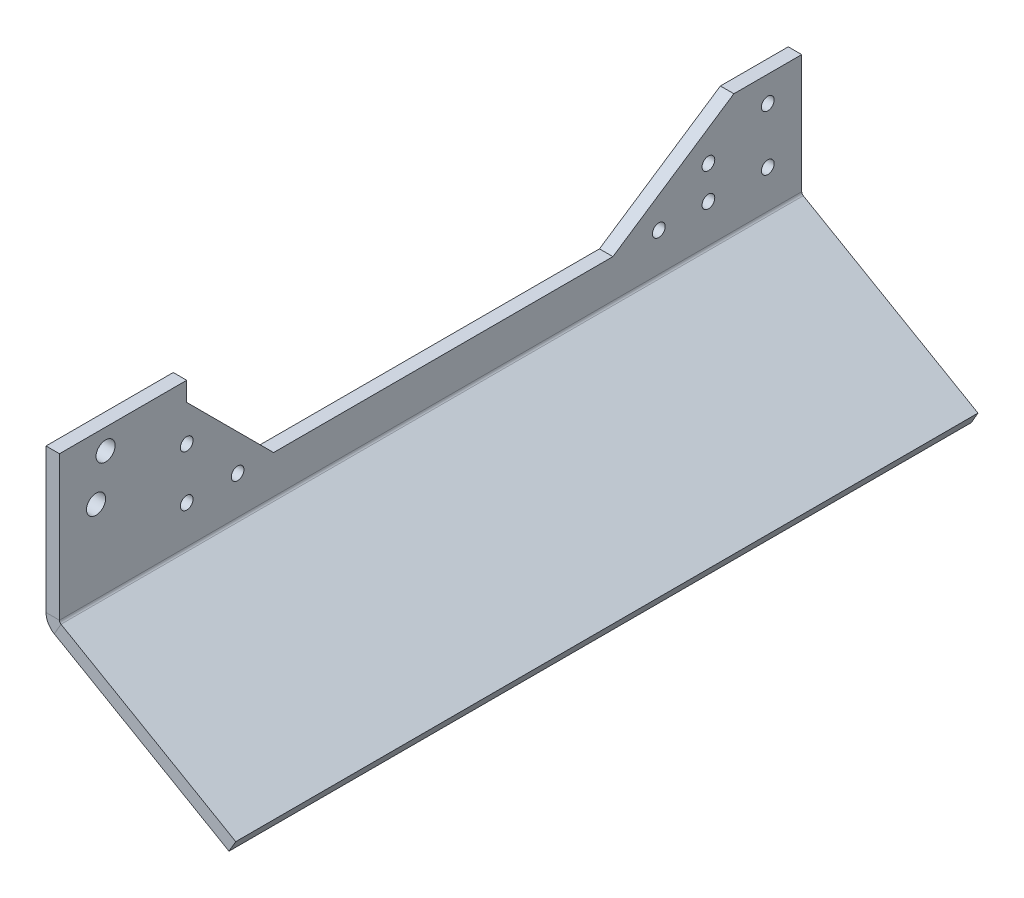
ISO-10303-21;
HEADER;
FILE_DESCRIPTION(('STEP AP214'),'2;1');
FILE_NAME('part.step','',(''),(''),'','','');
FILE_SCHEMA(('AUTOMOTIVE_DESIGN { 1 0 10303 214 1 1 1 1 }'));
ENDSEC;
DATA;
#1=APPLICATION_CONTEXT('core data for automotive mechanical design processes');
#2=APPLICATION_PROTOCOL_DEFINITION('international standard','automotive_design',2000,#1);
#3=PRODUCT_CONTEXT('',#1,'mechanical');
#4=PRODUCT('Part','Part','',(#3));
#5=PRODUCT_RELATED_PRODUCT_CATEGORY('part','',(#4));
#6=PRODUCT_DEFINITION_FORMATION('','',#4);
#7=PRODUCT_DEFINITION_CONTEXT('part definition',#1,'design');
#8=PRODUCT_DEFINITION('design','',#6,#7);
#9=PRODUCT_DEFINITION_SHAPE('','',#8);
#10=(LENGTH_UNIT() NAMED_UNIT(*) SI_UNIT(.MILLI.,.METRE.));
#11=(NAMED_UNIT(*) PLANE_ANGLE_UNIT() SI_UNIT($,.RADIAN.));
#12=(NAMED_UNIT(*) SI_UNIT($,.STERADIAN.) SOLID_ANGLE_UNIT());
#13=UNCERTAINTY_MEASURE_WITH_UNIT(LENGTH_MEASURE(1.E-05),#10,'distance_accuracy_value','');
#14=(GEOMETRIC_REPRESENTATION_CONTEXT(3) GLOBAL_UNCERTAINTY_ASSIGNED_CONTEXT((#13)) GLOBAL_UNIT_ASSIGNED_CONTEXT((#10,
#11,#12)) REPRESENTATION_CONTEXT('',''));
#15=CARTESIAN_POINT('',(0.,0.,0.));
#16=DIRECTION('',(0.,0.,1.));
#17=DIRECTION('',(1.,0.,0.));
#18=AXIS2_PLACEMENT_3D('',#15,#16,#17);
#19=CARTESIAN_POINT('',(1.43557444879162,0.578981601940387,0.));
#20=DIRECTION('',(0.499999999999998,0.86602540378444,0.));
#21=DIRECTION('',(0.,0.,-1.));
#22=AXIS2_PLACEMENT_3D('',#19,#20,#21);
#23=PLANE('',#22);
#24=DIRECTION('',(-0.86602540378444,0.499999999999998,0.));
#25=VECTOR('',#24,1.);
#26=CARTESIAN_POINT('',(44.7368446380136,-24.4210183980595,-160.884918300919));
#27=LINE('',#26,#25);
#28=CARTESIAN_POINT('',(44.7368446380136,-24.4210183980595,-160.884918300919));
#29=VERTEX_POINT('',#28);
#30=CARTESIAN_POINT('',(3.5433,-0.637914312427618,-160.884918300919));
#31=VERTEX_POINT('',#30);
#32=EDGE_CURVE('E46',#29,#31,#27,.T.);
#33=ORIENTED_EDGE('',*,*,#32,.T.);
#34=DIRECTION('',(0.,0.,1.));
#35=VECTOR('',#34,1.);
#36=CARTESIAN_POINT('',(3.5433,-0.637914312427617,0.));
#37=LINE('',#36,#35);
#38=CARTESIAN_POINT('',(3.5433,-0.637914312427615,14.1150816990808));
#39=VERTEX_POINT('',#38);
#40=EDGE_CURVE('E104',#31,#39,#37,.T.);
#41=ORIENTED_EDGE('',*,*,#40,.T.);
#42=DIRECTION('',(0.86602540378444,-0.499999999999998,0.));
#43=VECTOR('',#42,1.);
#44=CARTESIAN_POINT('',(-28.0092892798793,17.5789816019403,14.1150816990808));
#45=LINE('',#44,#43);
#46=CARTESIAN_POINT('',(44.7368446380136,-24.4210183980595,14.1150816990808));
#47=VERTEX_POINT('',#46);
#48=EDGE_CURVE('E91',#39,#47,#45,.T.);
#49=ORIENTED_EDGE('',*,*,#48,.T.);
#50=DIRECTION('',(0.,0.,-1.));
#51=VECTOR('',#50,1.);
#52=CARTESIAN_POINT('',(44.7368446380136,-24.4210183980595,14.1150816990808));
#53=LINE('',#52,#51);
#54=EDGE_CURVE('E67',#47,#29,#53,.T.);
#55=ORIENTED_EDGE('',*,*,#54,.T.);
#56=EDGE_LOOP('',(#33,#41,#49,#55));
#57=FACE_BOUND('',#56,.T.);
#58=ADVANCED_FACE('F42',(#57),#23,.T.);
#59=CARTESIAN_POINT('',(-0.15192555120837,-2.17064905507521,0.));
#60=DIRECTION('',(0.499999999999998,0.86602540378444,0.));
#61=DIRECTION('',(0.,0.,-1.));
#62=AXIS2_PLACEMENT_3D('',#59,#60,#61);
#63=PLANE('',#62);
#64=DIRECTION('',(0.,0.,1.));
#65=VECTOR('',#64,1.);
#66=CARTESIAN_POINT('',(1.95580000000001,-3.38754496944321,0.));
#67=LINE('',#66,#65);
#68=CARTESIAN_POINT('',(1.95580000000001,-3.38754496944321,-160.884918300919));
#69=VERTEX_POINT('',#68);
#70=CARTESIAN_POINT('',(1.95580000000001,-3.38754496944321,14.1150816990808));
#71=VERTEX_POINT('',#70);
#72=EDGE_CURVE('E51',#69,#71,#67,.T.);
#73=ORIENTED_EDGE('',*,*,#72,.F.);
#74=DIRECTION('',(-0.86602540378444,0.499999999999998,0.));
#75=VECTOR('',#74,1.);
#76=CARTESIAN_POINT('',(-24.4006368571727,11.8293509449247,-160.884918300919));
#77=LINE('',#76,#75);
#78=CARTESIAN_POINT('',(43.1493446380136,-27.1706490550751,-160.884918300919));
#79=VERTEX_POINT('',#78);
#80=EDGE_CURVE('E81',#79,#69,#77,.T.);
#81=ORIENTED_EDGE('',*,*,#80,.F.);
#82=DIRECTION('',(0.,0.,-1.));
#83=VECTOR('',#82,1.);
#84=CARTESIAN_POINT('',(43.1493446380136,-27.1706490550751,14.1150816990808));
#85=LINE('',#84,#83);
#86=CARTESIAN_POINT('',(43.1493446380136,-27.1706490550751,14.1150816990808));
#87=VERTEX_POINT('',#86);
#88=EDGE_CURVE('E85',#87,#79,#85,.T.);
#89=ORIENTED_EDGE('',*,*,#88,.F.);
#90=DIRECTION('',(0.86602540378444,-0.499999999999998,0.));
#91=VECTOR('',#90,1.);
#92=CARTESIAN_POINT('',(-0.15192555120837,-2.17064905507521,14.1150816990808));
#93=LINE('',#92,#91);
#94=EDGE_CURVE('E100',#71,#87,#93,.T.);
#95=ORIENTED_EDGE('',*,*,#94,.F.);
#96=EDGE_LOOP('',(#73,#81,#89,#95));
#97=FACE_BOUND('',#96,.T.);
#98=ADVANCED_FACE('F83',(#97),#63,.F.);
#99=CARTESIAN_POINT('',(1.43557444879162,0.578981601940387,14.1150816990808));
#100=DIRECTION('',(0.,0.,-1.));
#101=DIRECTION('',(-0.86602540378444,0.499999999999998,0.));
#102=AXIS2_PLACEMENT_3D('',#99,#100,#101);
#103=PLANE('',#102);
#104=DIRECTION('',(0.499999999999998,0.86602540378444,0.));
#105=VECTOR('',#104,1.);
#106=CARTESIAN_POINT('',(3.5433,-0.637914312427617,14.1150816990808));
#107=LINE('',#106,#105);
#108=EDGE_CURVE('E12',#71,#39,#107,.T.);
#109=ORIENTED_EDGE('',*,*,#108,.F.);
#110=ORIENTED_EDGE('',*,*,#94,.T.);
#111=DIRECTION('',(-0.499999999999998,-0.86602540378444,0.));
#112=VECTOR('',#111,1.);
#113=CARTESIAN_POINT('',(44.7368446380136,-24.4210183980595,14.1150816990808));
#114=LINE('',#113,#112);
#115=EDGE_CURVE('E99',#47,#87,#114,.T.);
#116=ORIENTED_EDGE('',*,*,#115,.F.);
#117=ORIENTED_EDGE('',*,*,#48,.F.);
#118=EDGE_LOOP('',(#109,#110,#116,#117));
#119=FACE_BOUND('',#118,.T.);
#120=ADVANCED_FACE('F44',(#119),#103,.F.);
#121=CARTESIAN_POINT('',(44.7368446380136,-24.4210183980595,14.1150816990808));
#122=DIRECTION('',(-0.86602540378444,0.499999999999998,0.));
#123=DIRECTION('',(0.,0.,1.));
#124=AXIS2_PLACEMENT_3D('',#121,#122,#123);
#125=PLANE('',#124);
#126=ORIENTED_EDGE('',*,*,#88,.T.);
#127=DIRECTION('',(-0.499999999999998,-0.86602540378444,0.));
#128=VECTOR('',#127,1.);
#129=CARTESIAN_POINT('',(44.7368446380136,-24.4210183980595,-160.884918300919));
#130=LINE('',#129,#128);
#131=EDGE_CURVE('E96',#29,#79,#130,.T.);
#132=ORIENTED_EDGE('',*,*,#131,.F.);
#133=ORIENTED_EDGE('',*,*,#54,.F.);
#134=ORIENTED_EDGE('',*,*,#115,.T.);
#135=EDGE_LOOP('',(#126,#132,#133,#134));
#136=FACE_BOUND('',#135,.T.);
#137=ADVANCED_FACE('F95',(#136),#125,.F.);
#138=CARTESIAN_POINT('',(-22.8131368571727,14.5789816019403,-160.884918300919));
#139=DIRECTION('',(0.,0.,1.));
#140=DIRECTION('',(0.499999999999998,0.86602540378444,0.));
#141=AXIS2_PLACEMENT_3D('',#138,#139,#140);
#142=PLANE('',#141);
#143=DIRECTION('',(-0.499999999999998,-0.86602540378444,0.));
#144=VECTOR('',#143,1.);
#145=CARTESIAN_POINT('',(3.5433,-0.637914312427617,-160.884918300919));
#146=LINE('',#145,#144);
#147=EDGE_CURVE('E110',#31,#69,#146,.T.);
#148=ORIENTED_EDGE('',*,*,#147,.F.);
#149=ORIENTED_EDGE('',*,*,#32,.F.);
#150=ORIENTED_EDGE('',*,*,#131,.T.);
#151=ORIENTED_EDGE('',*,*,#80,.T.);
#152=EDGE_LOOP('',(#148,#149,#150,#151));
#153=FACE_BOUND('',#152,.T.);
#154=ADVANCED_FACE('F102',(#153),#142,.F.);
#155=CARTESIAN_POINT('',(3.175,16.7921072428128,-138.88491830092));
#156=DIRECTION('',(-1.,0.,0.));
#157=DIRECTION('',(0.,0.,1.));
#158=AXIS2_PLACEMENT_3D('',#155,#156,#157);
#159=CYLINDRICAL_SURFACE('',#158,1.5);
#160=CARTESIAN_POINT('',(3.175,16.7921072428128,-138.88491830092));
#161=DIRECTION('',(1.,0.,0.));
#162=DIRECTION('',(0.,0.,-1.));
#163=AXIS2_PLACEMENT_3D('',#160,#161,#162);
#164=CIRCLE('',#163,1.5);
#165=CARTESIAN_POINT('',(3.175,16.7921072428128,-140.38491830092));
#166=VERTEX_POINT('',#165);
#167=EDGE_CURVE('E119',#166,#166,#164,.T.);
#168=ORIENTED_EDGE('',*,*,#167,.T.);
#169=EDGE_LOOP('',(#168));
#170=FACE_BOUND('',#169,.T.);
#171=CARTESIAN_POINT('',(0.,16.7921072428128,-138.88491830092));
#172=DIRECTION('',(1.,0.,0.));
#173=DIRECTION('',(0.,0.,-1.));
#174=AXIS2_PLACEMENT_3D('',#171,#172,#173);
#175=CIRCLE('',#174,1.5);
#176=CARTESIAN_POINT('',(0.,16.7921072428128,-140.38491830092));
#177=VERTEX_POINT('',#176);
#178=EDGE_CURVE('E242',#177,#177,#175,.T.);
#179=ORIENTED_EDGE('',*,*,#178,.F.);
#180=EDGE_LOOP('',(#179));
#181=FACE_BOUND('',#180,.T.);
#182=ADVANCED_FACE('F378',(#170,#181),#159,.F.);
#183=CARTESIAN_POINT('',(3.175,9.,-138.88491830092));
#184=DIRECTION('',(-1.,0.,0.));
#185=DIRECTION('',(0.,0.,1.));
#186=AXIS2_PLACEMENT_3D('',#183,#184,#185);
#187=CYLINDRICAL_SURFACE('',#186,1.5);
#188=CARTESIAN_POINT('',(3.175,9.,-138.88491830092));
#189=DIRECTION('',(1.,0.,0.));
#190=DIRECTION('',(0.,0.,-1.));
#191=AXIS2_PLACEMENT_3D('',#188,#189,#190);
#192=CIRCLE('',#191,1.5);
#193=CARTESIAN_POINT('',(3.175,9.,-140.38491830092));
#194=VERTEX_POINT('',#193);
#195=EDGE_CURVE('E122',#194,#194,#192,.T.);
#196=ORIENTED_EDGE('',*,*,#195,.T.);
#197=EDGE_LOOP('',(#196));
#198=FACE_BOUND('',#197,.T.);
#199=CARTESIAN_POINT('',(0.,9.,-138.88491830092));
#200=DIRECTION('',(1.,0.,0.));
#201=DIRECTION('',(0.,0.,-1.));
#202=AXIS2_PLACEMENT_3D('',#199,#200,#201);
#203=CIRCLE('',#202,1.5);
#204=CARTESIAN_POINT('',(0.,9.,-140.38491830092));
#205=VERTEX_POINT('',#204);
#206=EDGE_CURVE('E236',#205,#205,#203,.T.);
#207=ORIENTED_EDGE('',*,*,#206,.F.);
#208=EDGE_LOOP('',(#207));
#209=FACE_BOUND('',#208,.T.);
#210=ADVANCED_FACE('F383',(#198,#209),#187,.F.);
#211=CARTESIAN_POINT('',(3.175,8.99999999999999,-15.8849183009192));
#212=DIRECTION('',(-1.,0.,0.));
#213=DIRECTION('',(0.,0.,1.));
#214=AXIS2_PLACEMENT_3D('',#211,#212,#213);
#215=CYLINDRICAL_SURFACE('',#214,1.49999999999978);
#216=CARTESIAN_POINT('',(3.175,8.99999999999999,-15.8849183009192));
#217=DIRECTION('',(1.,0.,0.));
#218=DIRECTION('',(0.,0.,-1.));
#219=AXIS2_PLACEMENT_3D('',#216,#217,#218);
#220=CIRCLE('',#219,1.49999999999978);
#221=CARTESIAN_POINT('',(3.175,8.99999999999999,-17.384918300919));
#222=VERTEX_POINT('',#221);
#223=EDGE_CURVE('E125',#222,#222,#220,.T.);
#224=ORIENTED_EDGE('',*,*,#223,.T.);
#225=EDGE_LOOP('',(#224));
#226=FACE_BOUND('',#225,.T.);
#227=CARTESIAN_POINT('',(0.,8.99999999999999,-15.8849183009192));
#228=DIRECTION('',(1.,0.,0.));
#229=DIRECTION('',(0.,0.,-1.));
#230=AXIS2_PLACEMENT_3D('',#227,#228,#229);
#231=CIRCLE('',#230,1.49999999999978);
#232=CARTESIAN_POINT('',(0.,8.99999999999999,-17.384918300919));
#233=VERTEX_POINT('',#232);
#234=EDGE_CURVE('E230',#233,#233,#231,.T.);
#235=ORIENTED_EDGE('',*,*,#234,.F.);
#236=EDGE_LOOP('',(#235));
#237=FACE_BOUND('',#236,.T.);
#238=ADVANCED_FACE('F406',(#226,#237),#215,.F.);
#239=CARTESIAN_POINT('',(3.175,9.,-152.884918300919));
#240=DIRECTION('',(-1.,0.,0.));
#241=DIRECTION('',(0.,0.,1.));
#242=AXIS2_PLACEMENT_3D('',#239,#240,#241);
#243=CYLINDRICAL_SURFACE('',#242,1.5);
#244=CARTESIAN_POINT('',(3.175,9.,-152.884918300919));
#245=DIRECTION('',(1.,0.,0.));
#246=DIRECTION('',(0.,0.,-1.));
#247=AXIS2_PLACEMENT_3D('',#244,#245,#246);
#248=CIRCLE('',#247,1.5);
#249=CARTESIAN_POINT('',(3.175,9.,-154.384918300919));
#250=VERTEX_POINT('',#249);
#251=EDGE_CURVE('E128',#250,#250,#248,.T.);
#252=ORIENTED_EDGE('',*,*,#251,.T.);
#253=EDGE_LOOP('',(#252));
#254=FACE_BOUND('',#253,.T.);
#255=CARTESIAN_POINT('',(0.,9.,-152.884918300919));
#256=DIRECTION('',(1.,0.,0.));
#257=DIRECTION('',(0.,0.,-1.));
#258=AXIS2_PLACEMENT_3D('',#255,#256,#257);
#259=CIRCLE('',#258,1.5);
#260=CARTESIAN_POINT('',(0.,9.,-154.384918300919));
#261=VERTEX_POINT('',#260);
#262=EDGE_CURVE('E224',#261,#261,#259,.T.);
#263=ORIENTED_EDGE('',*,*,#262,.F.);
#264=EDGE_LOOP('',(#263));
#265=FACE_BOUND('',#264,.T.);
#266=ADVANCED_FACE('F410',(#254,#265),#243,.F.);
#267=CARTESIAN_POINT('',(3.175,22.,-152.884918300919));
#268=DIRECTION('',(-1.,0.,0.));
#269=DIRECTION('',(0.,0.,1.));
#270=AXIS2_PLACEMENT_3D('',#267,#268,#269);
#271=CYLINDRICAL_SURFACE('',#270,1.5);
#272=CARTESIAN_POINT('',(3.175,22.,-152.884918300919));
#273=DIRECTION('',(1.,0.,0.));
#274=DIRECTION('',(0.,0.,-1.));
#275=AXIS2_PLACEMENT_3D('',#272,#273,#274);
#276=CIRCLE('',#275,1.5);
#277=CARTESIAN_POINT('',(3.175,22.,-154.384918300919));
#278=VERTEX_POINT('',#277);
#279=EDGE_CURVE('E131',#278,#278,#276,.T.);
#280=ORIENTED_EDGE('',*,*,#279,.T.);
#281=EDGE_LOOP('',(#280));
#282=FACE_BOUND('',#281,.T.);
#283=CARTESIAN_POINT('',(0.,22.,-152.884918300919));
#284=DIRECTION('',(1.,0.,0.));
#285=DIRECTION('',(0.,0.,-1.));
#286=AXIS2_PLACEMENT_3D('',#283,#284,#285);
#287=CIRCLE('',#286,1.5);
#288=CARTESIAN_POINT('',(0.,22.,-154.384918300919));
#289=VERTEX_POINT('',#288);
#290=EDGE_CURVE('E218',#289,#289,#287,.T.);
#291=ORIENTED_EDGE('',*,*,#290,.F.);
#292=EDGE_LOOP('',(#291));
#293=FACE_BOUND('',#292,.T.);
#294=ADVANCED_FACE('F414',(#282,#293),#271,.F.);
#295=CARTESIAN_POINT('',(3.175,29.1280440215269,3.23937923257457));
#296=DIRECTION('',(-1.,0.,0.));
#297=DIRECTION('',(0.,0.,1.));
#298=AXIS2_PLACEMENT_3D('',#295,#296,#297);
#299=CYLINDRICAL_SURFACE('',#298,2.25);
#300=CARTESIAN_POINT('',(3.175,29.1280440215269,3.23937923257457));
#301=DIRECTION('',(1.,0.,0.));
#302=DIRECTION('',(0.,0.,-1.));
#303=AXIS2_PLACEMENT_3D('',#300,#301,#302);
#304=CIRCLE('',#303,2.25);
#305=CARTESIAN_POINT('',(3.175,29.1280440215269,0.989379232574577));
#306=VERTEX_POINT('',#305);
#307=EDGE_CURVE('E134',#306,#306,#304,.T.);
#308=ORIENTED_EDGE('',*,*,#307,.T.);
#309=EDGE_LOOP('',(#308));
#310=FACE_BOUND('',#309,.T.);
#311=CARTESIAN_POINT('',(0.,29.1280440215269,3.23937923257457));
#312=DIRECTION('',(1.,0.,0.));
#313=DIRECTION('',(0.,0.,-1.));
#314=AXIS2_PLACEMENT_3D('',#311,#312,#313);
#315=CIRCLE('',#314,2.25);
#316=CARTESIAN_POINT('',(0.,29.1280440215269,0.989379232574577));
#317=VERTEX_POINT('',#316);
#318=EDGE_CURVE('E215',#317,#317,#315,.T.);
#319=ORIENTED_EDGE('',*,*,#318,.F.);
#320=EDGE_LOOP('',(#319));
#321=FACE_BOUND('',#320,.T.);
#322=ADVANCED_FACE('F418',(#310,#321),#299,.F.);
#323=CARTESIAN_POINT('',(3.175,19.3841320645807,5.48797429956215));
#324=DIRECTION('',(-1.,0.,0.));
#325=DIRECTION('',(0.,0.,1.));
#326=AXIS2_PLACEMENT_3D('',#323,#324,#325);
#327=CYLINDRICAL_SURFACE('',#326,2.25);
#328=CARTESIAN_POINT('',(3.175,19.3841320645807,5.48797429956215));
#329=DIRECTION('',(1.,0.,0.));
#330=DIRECTION('',(0.,0.,-1.));
#331=AXIS2_PLACEMENT_3D('',#328,#329,#330);
#332=CIRCLE('',#331,2.25);
#333=CARTESIAN_POINT('',(3.175,19.3841320645807,3.23797429956215));
#334=VERTEX_POINT('',#333);
#335=EDGE_CURVE('E137',#334,#334,#332,.T.);
#336=ORIENTED_EDGE('',*,*,#335,.T.);
#337=EDGE_LOOP('',(#336));
#338=FACE_BOUND('',#337,.T.);
#339=CARTESIAN_POINT('',(0.,19.3841320645807,5.48797429956215));
#340=DIRECTION('',(1.,0.,0.));
#341=DIRECTION('',(0.,0.,-1.));
#342=AXIS2_PLACEMENT_3D('',#339,#340,#341);
#343=CIRCLE('',#342,2.25);
#344=CARTESIAN_POINT('',(0.,19.3841320645807,3.23797429956215));
#345=VERTEX_POINT('',#344);
#346=EDGE_CURVE('E221',#345,#345,#343,.T.);
#347=ORIENTED_EDGE('',*,*,#346,.F.);
#348=EDGE_LOOP('',(#347));
#349=FACE_BOUND('',#348,.T.);
#350=ADVANCED_FACE('F422',(#338,#349),#327,.F.);
#351=CARTESIAN_POINT('',(3.175,21.,-15.8849183009192));
#352=DIRECTION('',(-1.,0.,0.));
#353=DIRECTION('',(0.,0.,1.));
#354=AXIS2_PLACEMENT_3D('',#351,#352,#353);
#355=CYLINDRICAL_SURFACE('',#354,1.5);
#356=CARTESIAN_POINT('',(3.175,21.,-15.8849183009192));
#357=DIRECTION('',(1.,0.,0.));
#358=DIRECTION('',(0.,0.,-1.));
#359=AXIS2_PLACEMENT_3D('',#356,#357,#358);
#360=CIRCLE('',#359,1.5);
#361=CARTESIAN_POINT('',(3.175,21.,-17.3849183009192));
#362=VERTEX_POINT('',#361);
#363=EDGE_CURVE('E140',#362,#362,#360,.T.);
#364=ORIENTED_EDGE('',*,*,#363,.T.);
#365=EDGE_LOOP('',(#364));
#366=FACE_BOUND('',#365,.T.);
#367=CARTESIAN_POINT('',(0.,21.,-15.8849183009192));
#368=DIRECTION('',(1.,0.,0.));
#369=DIRECTION('',(0.,0.,-1.));
#370=AXIS2_PLACEMENT_3D('',#367,#368,#369);
#371=CIRCLE('',#370,1.5);
#372=CARTESIAN_POINT('',(0.,21.,-17.3849183009192));
#373=VERTEX_POINT('',#372);
#374=EDGE_CURVE('E227',#373,#373,#371,.T.);
#375=ORIENTED_EDGE('',*,*,#374,.F.);
#376=EDGE_LOOP('',(#375));
#377=FACE_BOUND('',#376,.T.);
#378=ADVANCED_FACE('F426',(#366,#377),#355,.F.);
#379=CARTESIAN_POINT('',(3.175,8.99999999999998,-27.8849183009192));
#380=DIRECTION('',(-1.,0.,0.));
#381=DIRECTION('',(0.,0.,1.));
#382=AXIS2_PLACEMENT_3D('',#379,#380,#381);
#383=CYLINDRICAL_SURFACE('',#382,1.5);
#384=CARTESIAN_POINT('',(3.175,8.99999999999998,-27.8849183009192));
#385=DIRECTION('',(1.,0.,0.));
#386=DIRECTION('',(0.,0.,-1.));
#387=AXIS2_PLACEMENT_3D('',#384,#385,#386);
#388=CIRCLE('',#387,1.5);
#389=CARTESIAN_POINT('',(3.175,8.99999999999998,-29.3849183009192));
#390=VERTEX_POINT('',#389);
#391=EDGE_CURVE('E143',#390,#390,#388,.T.);
#392=ORIENTED_EDGE('',*,*,#391,.T.);
#393=EDGE_LOOP('',(#392));
#394=FACE_BOUND('',#393,.T.);
#395=CARTESIAN_POINT('',(0.,8.99999999999998,-27.8849183009192));
#396=DIRECTION('',(1.,0.,0.));
#397=DIRECTION('',(0.,0.,-1.));
#398=AXIS2_PLACEMENT_3D('',#395,#396,#397);
#399=CIRCLE('',#398,1.5);
#400=CARTESIAN_POINT('',(0.,8.99999999999998,-29.3849183009192));
#401=VERTEX_POINT('',#400);
#402=EDGE_CURVE('E233',#401,#401,#399,.T.);
#403=ORIENTED_EDGE('',*,*,#402,.F.);
#404=EDGE_LOOP('',(#403));
#405=FACE_BOUND('',#404,.T.);
#406=ADVANCED_FACE('F430',(#394,#405),#383,.F.);
#407=CARTESIAN_POINT('',(3.175,9.,-127.190721167732));
#408=DIRECTION('',(-1.,0.,0.));
#409=DIRECTION('',(0.,0.,1.));
#410=AXIS2_PLACEMENT_3D('',#407,#408,#409);
#411=CYLINDRICAL_SURFACE('',#410,1.50000000000003);
#412=CARTESIAN_POINT('',(3.175,9.,-127.190721167732));
#413=DIRECTION('',(1.,0.,0.));
#414=DIRECTION('',(0.,0.,-1.));
#415=AXIS2_PLACEMENT_3D('',#412,#413,#414);
#416=CIRCLE('',#415,1.50000000000003);
#417=CARTESIAN_POINT('',(3.175,9.,-128.690721167732));
#418=VERTEX_POINT('',#417);
#419=EDGE_CURVE('E146',#418,#418,#416,.T.);
#420=ORIENTED_EDGE('',*,*,#419,.T.);
#421=EDGE_LOOP('',(#420));
#422=FACE_BOUND('',#421,.T.);
#423=CARTESIAN_POINT('',(0.,9.,-127.190721167732));
#424=DIRECTION('',(1.,0.,0.));
#425=DIRECTION('',(0.,0.,-1.));
#426=AXIS2_PLACEMENT_3D('',#423,#424,#425);
#427=CIRCLE('',#426,1.50000000000003);
#428=CARTESIAN_POINT('',(0.,9.,-128.690721167732));
#429=VERTEX_POINT('',#428);
#430=EDGE_CURVE('E239',#429,#429,#427,.T.);
#431=ORIENTED_EDGE('',*,*,#430,.F.);
#432=EDGE_LOOP('',(#431));
#433=FACE_BOUND('',#432,.T.);
#434=ADVANCED_FACE('F434',(#422,#433),#411,.F.);
#435=CARTESIAN_POINT('',(3.175,34.,-15.8849183009192));
#436=DIRECTION('',(0.,-1.,0.));
#437=DIRECTION('',(0.,0.,-1.));
#438=AXIS2_PLACEMENT_3D('',#435,#436,#437);
#439=PLANE('',#438);
#440=DIRECTION('',(0.,0.,1.));
#441=VECTOR('',#440,1.);
#442=CARTESIAN_POINT('',(0.,34.,-15.8849183009192));
#443=LINE('',#442,#441);
#444=CARTESIAN_POINT('',(0.,34.,-15.8849183009192));
#445=VERTEX_POINT('',#444);
#446=CARTESIAN_POINT('',(0.,34.,14.1150816990808));
#447=VERTEX_POINT('',#446);
#448=EDGE_CURVE('E149',#445,#447,#443,.T.);
#449=ORIENTED_EDGE('',*,*,#448,.T.);
#450=DIRECTION('',(-1.,0.,0.));
#451=VECTOR('',#450,1.);
#452=CARTESIAN_POINT('',(3.175,34.,14.1150816990808));
#453=LINE('',#452,#451);
#454=CARTESIAN_POINT('',(3.175,34.,14.1150816990808));
#455=VERTEX_POINT('',#454);
#456=EDGE_CURVE('E114',#455,#447,#453,.T.);
#457=ORIENTED_EDGE('',*,*,#456,.F.);
#458=DIRECTION('',(0.,0.,1.));
#459=VECTOR('',#458,1.);
#460=CARTESIAN_POINT('',(3.175,34.,-15.8849183009192));
#461=LINE('',#460,#459);
#462=CARTESIAN_POINT('',(3.175,34.,-15.8849183009192));
#463=VERTEX_POINT('',#462);
#464=EDGE_CURVE('E203',#463,#455,#461,.T.);
#465=ORIENTED_EDGE('',*,*,#464,.F.);
#466=DIRECTION('',(-1.,0.,0.));
#467=VECTOR('',#466,1.);
#468=CARTESIAN_POINT('',(3.175,34.,-15.8849183009192));
#469=LINE('',#468,#467);
#470=EDGE_CURVE('E152',#463,#445,#469,.T.);
#471=ORIENTED_EDGE('',*,*,#470,.T.);
#472=EDGE_LOOP('',(#449,#457,#465,#471));
#473=FACE_BOUND('',#472,.T.);
#474=ADVANCED_FACE('F347',(#473),#439,.F.);
#475=CARTESIAN_POINT('',(3.175,29.4852813742386,-15.8849183009192));
#476=DIRECTION('',(0.,0.,1.));
#477=DIRECTION('',(1.,0.,0.));
#478=AXIS2_PLACEMENT_3D('',#475,#476,#477);
#479=PLANE('',#478);
#480=DIRECTION('',(0.,1.,0.));
#481=VECTOR('',#480,1.);
#482=CARTESIAN_POINT('',(0.,29.4852813742386,-15.8849183009192));
#483=LINE('',#482,#481);
#484=CARTESIAN_POINT('',(0.,29.4852813742386,-15.8849183009192));
#485=VERTEX_POINT('',#484);
#486=EDGE_CURVE('E155',#485,#445,#483,.T.);
#487=ORIENTED_EDGE('',*,*,#486,.T.);
#488=ORIENTED_EDGE('',*,*,#470,.F.);
#489=DIRECTION('',(0.,1.,0.));
#490=VECTOR('',#489,1.);
#491=CARTESIAN_POINT('',(3.175,29.4852813742386,-15.8849183009192));
#492=LINE('',#491,#490);
#493=CARTESIAN_POINT('',(3.175,29.4852813742386,-15.8849183009192));
#494=VERTEX_POINT('',#493);
#495=EDGE_CURVE('E200',#494,#463,#492,.T.);
#496=ORIENTED_EDGE('',*,*,#495,.F.);
#497=DIRECTION('',(-1.,0.,0.));
#498=VECTOR('',#497,1.);
#499=CARTESIAN_POINT('',(3.175,29.4852813742386,-15.8849183009192));
#500=LINE('',#499,#498);
#501=EDGE_CURVE('E158',#494,#485,#500,.T.);
#502=ORIENTED_EDGE('',*,*,#501,.T.);
#503=EDGE_LOOP('',(#487,#488,#496,#502));
#504=FACE_BOUND('',#503,.T.);
#505=ADVANCED_FACE('F343',(#504),#479,.F.);
#506=CARTESIAN_POINT('',(3.175,8.99999999999999,-36.3701996751578));
#507=DIRECTION('',(0.,-0.707106781186548,0.707106781186547));
#508=DIRECTION('',(0.,-0.707106781186547,-0.707106781186548));
#509=AXIS2_PLACEMENT_3D('',#506,#507,#508);
#510=PLANE('',#509);
#511=DIRECTION('',(0.,0.707106781186547,0.707106781186548));
#512=VECTOR('',#511,1.);
#513=CARTESIAN_POINT('',(0.,8.99999999999999,-36.3701996751578));
#514=LINE('',#513,#512);
#515=CARTESIAN_POINT('',(0.,8.99999999999999,-36.3701996751578));
#516=VERTEX_POINT('',#515);
#517=EDGE_CURVE('E161',#516,#485,#514,.T.);
#518=ORIENTED_EDGE('',*,*,#517,.T.);
#519=ORIENTED_EDGE('',*,*,#501,.F.);
#520=DIRECTION('',(0.,0.707106781186547,0.707106781186548));
#521=VECTOR('',#520,1.);
#522=CARTESIAN_POINT('',(3.175,8.99999999999999,-36.3701996751578));
#523=LINE('',#522,#521);
#524=CARTESIAN_POINT('',(3.175,8.99999999999999,-36.3701996751578));
#525=VERTEX_POINT('',#524);
#526=EDGE_CURVE('E197',#525,#494,#523,.T.);
#527=ORIENTED_EDGE('',*,*,#526,.F.);
#528=DIRECTION('',(-1.,0.,0.));
#529=VECTOR('',#528,1.);
#530=CARTESIAN_POINT('',(3.175,8.99999999999999,-36.3701996751578));
#531=LINE('',#530,#529);
#532=EDGE_CURVE('E164',#525,#516,#531,.T.);
#533=ORIENTED_EDGE('',*,*,#532,.T.);
#534=EDGE_LOOP('',(#518,#519,#527,#533));
#535=FACE_BOUND('',#534,.T.);
#536=ADVANCED_FACE('F338',(#535),#510,.F.);
#537=CARTESIAN_POINT('',(3.175,9.,-116.370199675158));
#538=DIRECTION('',(0.,-1.,0.));
#539=DIRECTION('',(0.,0.,-1.));
#540=AXIS2_PLACEMENT_3D('',#537,#538,#539);
#541=PLANE('',#540);
#542=DIRECTION('',(0.,0.,1.));
#543=VECTOR('',#542,1.);
#544=CARTESIAN_POINT('',(0.,9.,-116.370199675158));
#545=LINE('',#544,#543);
#546=CARTESIAN_POINT('',(0.,9.,-116.370199675158));
#547=VERTEX_POINT('',#546);
#548=EDGE_CURVE('E167',#547,#516,#545,.T.);
#549=ORIENTED_EDGE('',*,*,#548,.T.);
#550=ORIENTED_EDGE('',*,*,#532,.F.);
#551=DIRECTION('',(0.,0.,1.));
#552=VECTOR('',#551,1.);
#553=CARTESIAN_POINT('',(3.175,9.,-116.370199675158));
#554=LINE('',#553,#552);
#555=CARTESIAN_POINT('',(3.175,9.,-116.370199675158));
#556=VERTEX_POINT('',#555);
#557=EDGE_CURVE('E194',#556,#525,#554,.T.);
#558=ORIENTED_EDGE('',*,*,#557,.F.);
#559=DIRECTION('',(-1.,0.,0.));
#560=VECTOR('',#559,1.);
#561=CARTESIAN_POINT('',(3.175,9.,-116.370199675158));
#562=LINE('',#561,#560);
#563=EDGE_CURVE('E170',#556,#547,#562,.T.);
#564=ORIENTED_EDGE('',*,*,#563,.T.);
#565=EDGE_LOOP('',(#549,#550,#558,#564));
#566=FACE_BOUND('',#565,.T.);
#567=ADVANCED_FACE('F334',(#566),#541,.F.);
#568=CARTESIAN_POINT('',(3.175,28.,-144.884918300919));
#569=DIRECTION('',(0.,-0.832182440861265,-0.554501925264635));
#570=DIRECTION('',(0.,0.554501925264635,-0.832182440861266));
#571=AXIS2_PLACEMENT_3D('',#568,#569,#570);
#572=PLANE('',#571);
#573=DIRECTION('',(0.,-0.554501925264635,0.832182440861265));
#574=VECTOR('',#573,1.);
#575=CARTESIAN_POINT('',(0.,28.,-144.884918300919));
#576=LINE('',#575,#574);
#577=CARTESIAN_POINT('',(0.,28.,-144.884918300919));
#578=VERTEX_POINT('',#577);
#579=EDGE_CURVE('E173',#578,#547,#576,.T.);
#580=ORIENTED_EDGE('',*,*,#579,.T.);
#581=ORIENTED_EDGE('',*,*,#563,.F.);
#582=DIRECTION('',(0.,-0.554501925264635,0.832182440861265));
#583=VECTOR('',#582,1.);
#584=CARTESIAN_POINT('',(3.175,28.,-144.884918300919));
#585=LINE('',#584,#583);
#586=CARTESIAN_POINT('',(3.175,28.,-144.884918300919));
#587=VERTEX_POINT('',#586);
#588=EDGE_CURVE('E191',#587,#556,#585,.T.);
#589=ORIENTED_EDGE('',*,*,#588,.F.);
#590=DIRECTION('',(-1.,0.,0.));
#591=VECTOR('',#590,1.);
#592=CARTESIAN_POINT('',(3.175,28.,-144.884918300919));
#593=LINE('',#592,#591);
#594=EDGE_CURVE('E176',#587,#578,#593,.T.);
#595=ORIENTED_EDGE('',*,*,#594,.T.);
#596=EDGE_LOOP('',(#580,#581,#589,#595));
#597=FACE_BOUND('',#596,.T.);
#598=ADVANCED_FACE('F360',(#597),#572,.F.);
#599=CARTESIAN_POINT('',(3.175,28.,-160.884918300919));
#600=DIRECTION('',(0.,-1.,0.));
#601=DIRECTION('',(0.,0.,-1.));
#602=AXIS2_PLACEMENT_3D('',#599,#600,#601);
#603=PLANE('',#602);
#604=DIRECTION('',(0.,0.,1.));
#605=VECTOR('',#604,1.);
#606=CARTESIAN_POINT('',(0.,28.,-160.884918300919));
#607=LINE('',#606,#605);
#608=CARTESIAN_POINT('',(0.,28.,-160.884918300919));
#609=VERTEX_POINT('',#608);
#610=EDGE_CURVE('E179',#609,#578,#607,.T.);
#611=ORIENTED_EDGE('',*,*,#610,.T.);
#612=ORIENTED_EDGE('',*,*,#594,.F.);
#613=DIRECTION('',(0.,0.,1.));
#614=VECTOR('',#613,1.);
#615=CARTESIAN_POINT('',(3.175,28.,-160.884918300919));
#616=LINE('',#615,#614);
#617=CARTESIAN_POINT('',(3.175,28.,-160.884918300919));
#618=VERTEX_POINT('',#617);
#619=EDGE_CURVE('E188',#618,#587,#616,.T.);
#620=ORIENTED_EDGE('',*,*,#619,.F.);
#621=DIRECTION('',(-1.,0.,0.));
#622=VECTOR('',#621,1.);
#623=CARTESIAN_POINT('',(3.175,28.,-160.884918300919));
#624=LINE('',#623,#622);
#625=EDGE_CURVE('E182',#618,#609,#624,.T.);
#626=ORIENTED_EDGE('',*,*,#625,.T.);
#627=EDGE_LOOP('',(#611,#612,#620,#626));
#628=FACE_BOUND('',#627,.T.);
#629=ADVANCED_FACE('F293',(#628),#603,.F.);
#630=CARTESIAN_POINT('',(3.175,0.,0.));
#631=DIRECTION('',(1.,0.,0.));
#632=DIRECTION('',(0.,0.,-1.));
#633=AXIS2_PLACEMENT_3D('',#630,#631,#632);
#634=PLANE('',#633);
#635=DIRECTION('',(0.,0.,1.));
#636=VECTOR('',#635,1.);
#637=CARTESIAN_POINT('',(3.175,0.,0.));
#638=LINE('',#637,#636);
#639=CARTESIAN_POINT('',(3.175,0.,-160.884918300919));
#640=VERTEX_POINT('',#639);
#641=CARTESIAN_POINT('',(3.175,0.,14.1150816990808));
#642=VERTEX_POINT('',#641);
#643=EDGE_CURVE('E117',#640,#642,#638,.T.);
#644=ORIENTED_EDGE('',*,*,#643,.F.);
#645=DIRECTION('',(0.,1.,0.));
#646=VECTOR('',#645,1.);
#647=CARTESIAN_POINT('',(3.175,-50.,-160.884918300919));
#648=LINE('',#647,#646);
#649=EDGE_CURVE('E185',#640,#618,#648,.T.);
#650=ORIENTED_EDGE('',*,*,#649,.T.);
#651=ORIENTED_EDGE('',*,*,#619,.T.);
#652=ORIENTED_EDGE('',*,*,#588,.T.);
#653=ORIENTED_EDGE('',*,*,#557,.T.);
#654=ORIENTED_EDGE('',*,*,#526,.T.);
#655=ORIENTED_EDGE('',*,*,#495,.T.);
#656=ORIENTED_EDGE('',*,*,#464,.T.);
#657=DIRECTION('',(0.,-1.,0.));
#658=VECTOR('',#657,1.);
#659=CARTESIAN_POINT('',(3.175,34.,14.1150816990808));
#660=LINE('',#659,#658);
#661=EDGE_CURVE('E206',#455,#642,#660,.T.);
#662=ORIENTED_EDGE('',*,*,#661,.T.);
#663=EDGE_LOOP('',(#644,#650,#651,#652,#653,#654,#655,#656,#662));
#664=FACE_BOUND('',#663,.T.);
#665=ORIENTED_EDGE('',*,*,#419,.F.);
#666=EDGE_LOOP('',(#665));
#667=FACE_BOUND('',#666,.T.);
#668=ORIENTED_EDGE('',*,*,#391,.F.);
#669=EDGE_LOOP('',(#668));
#670=FACE_BOUND('',#669,.T.);
#671=ORIENTED_EDGE('',*,*,#363,.F.);
#672=EDGE_LOOP('',(#671));
#673=FACE_BOUND('',#672,.T.);
#674=ORIENTED_EDGE('',*,*,#335,.F.);
#675=EDGE_LOOP('',(#674));
#676=FACE_BOUND('',#675,.T.);
#677=ORIENTED_EDGE('',*,*,#307,.F.);
#678=EDGE_LOOP('',(#677));
#679=FACE_BOUND('',#678,.T.);
#680=ORIENTED_EDGE('',*,*,#279,.F.);
#681=EDGE_LOOP('',(#680));
#682=FACE_BOUND('',#681,.T.);
#683=ORIENTED_EDGE('',*,*,#251,.F.);
#684=EDGE_LOOP('',(#683));
#685=FACE_BOUND('',#684,.T.);
#686=ORIENTED_EDGE('',*,*,#223,.F.);
#687=EDGE_LOOP('',(#686));
#688=FACE_BOUND('',#687,.T.);
#689=ORIENTED_EDGE('',*,*,#195,.F.);
#690=EDGE_LOOP('',(#689));
#691=FACE_BOUND('',#690,.T.);
#692=ORIENTED_EDGE('',*,*,#167,.F.);
#693=EDGE_LOOP('',(#692));
#694=FACE_BOUND('',#693,.T.);
#695=ADVANCED_FACE('F276',(#664,#667,#670,#673,#676,#679,#682,#685,#688,#691,#694),#634,.T.);
#696=CARTESIAN_POINT('',(3.175,28.,-160.884918300919));
#697=DIRECTION('',(0.,0.,1.));
#698=DIRECTION('',(1.,0.,0.));
#699=AXIS2_PLACEMENT_3D('',#696,#697,#698);
#700=PLANE('',#699);
#701=ORIENTED_EDGE('',*,*,#649,.F.);
#702=DIRECTION('',(-1.,0.,0.));
#703=VECTOR('',#702,1.);
#704=CARTESIAN_POINT('',(3.175,0.,-160.884918300919));
#705=LINE('',#704,#703);
#706=CARTESIAN_POINT('',(0.,0.,-160.884918300919));
#707=VERTEX_POINT('',#706);
#708=EDGE_CURVE('E209',#640,#707,#705,.T.);
#709=ORIENTED_EDGE('',*,*,#708,.T.);
#710=DIRECTION('',(0.,1.,0.));
#711=VECTOR('',#710,1.);
#712=CARTESIAN_POINT('',(0.,28.,-160.884918300919));
#713=LINE('',#712,#711);
#714=EDGE_CURVE('E212',#707,#609,#713,.T.);
#715=ORIENTED_EDGE('',*,*,#714,.T.);
#716=ORIENTED_EDGE('',*,*,#625,.F.);
#717=EDGE_LOOP('',(#701,#709,#715,#716));
#718=FACE_BOUND('',#717,.T.);
#719=ADVANCED_FACE('F282',(#718),#700,.F.);
#720=CARTESIAN_POINT('',(0.,0.,0.));
#721=DIRECTION('',(1.,0.,0.));
#722=DIRECTION('',(0.,0.,-1.));
#723=AXIS2_PLACEMENT_3D('',#720,#721,#722);
#724=PLANE('',#723);
#725=ORIENTED_EDGE('',*,*,#318,.T.);
#726=EDGE_LOOP('',(#725));
#727=FACE_BOUND('',#726,.T.);
#728=ORIENTED_EDGE('',*,*,#290,.T.);
#729=EDGE_LOOP('',(#728));
#730=FACE_BOUND('',#729,.T.);
#731=ORIENTED_EDGE('',*,*,#346,.T.);
#732=EDGE_LOOP('',(#731));
#733=FACE_BOUND('',#732,.T.);
#734=ORIENTED_EDGE('',*,*,#262,.T.);
#735=EDGE_LOOP('',(#734));
#736=FACE_BOUND('',#735,.T.);
#737=ORIENTED_EDGE('',*,*,#374,.T.);
#738=EDGE_LOOP('',(#737));
#739=FACE_BOUND('',#738,.T.);
#740=ORIENTED_EDGE('',*,*,#234,.T.);
#741=EDGE_LOOP('',(#740));
#742=FACE_BOUND('',#741,.T.);
#743=ORIENTED_EDGE('',*,*,#402,.T.);
#744=EDGE_LOOP('',(#743));
#745=FACE_BOUND('',#744,.T.);
#746=ORIENTED_EDGE('',*,*,#206,.T.);
#747=EDGE_LOOP('',(#746));
#748=FACE_BOUND('',#747,.T.);
#749=ORIENTED_EDGE('',*,*,#430,.T.);
#750=EDGE_LOOP('',(#749));
#751=FACE_BOUND('',#750,.T.);
#752=ORIENTED_EDGE('',*,*,#178,.T.);
#753=EDGE_LOOP('',(#752));
#754=FACE_BOUND('',#753,.T.);
#755=ORIENTED_EDGE('',*,*,#714,.F.);
#756=DIRECTION('',(0.,0.,1.));
#757=VECTOR('',#756,1.);
#758=CARTESIAN_POINT('',(0.,0.,0.));
#759=LINE('',#758,#757);
#760=CARTESIAN_POINT('',(0.,0.,14.1150816990808));
#761=VERTEX_POINT('',#760);
#762=EDGE_CURVE('E245',#707,#761,#759,.T.);
#763=ORIENTED_EDGE('',*,*,#762,.T.);
#764=DIRECTION('',(0.,-1.,0.));
#765=VECTOR('',#764,1.);
#766=CARTESIAN_POINT('',(0.,0.,14.1150816990808));
#767=LINE('',#766,#765);
#768=EDGE_CURVE('E248',#447,#761,#767,.T.);
#769=ORIENTED_EDGE('',*,*,#768,.F.);
#770=ORIENTED_EDGE('',*,*,#448,.F.);
#771=ORIENTED_EDGE('',*,*,#486,.F.);
#772=ORIENTED_EDGE('',*,*,#517,.F.);
#773=ORIENTED_EDGE('',*,*,#548,.F.);
#774=ORIENTED_EDGE('',*,*,#579,.F.);
#775=ORIENTED_EDGE('',*,*,#610,.F.);
#776=EDGE_LOOP('',(#755,#763,#769,#770,#771,#772,#773,#774,#775));
#777=FACE_BOUND('',#776,.T.);
#778=ADVANCED_FACE('F357',(#727,#730,#733,#736,#739,#742,#745,#748,#751,#754,#777),#724,.F.);
#779=CARTESIAN_POINT('',(3.175,0.,14.1150816990808));
#780=DIRECTION('',(0.,0.,-1.));
#781=DIRECTION('',(0.,1.,0.));
#782=AXIS2_PLACEMENT_3D('',#779,#780,#781);
#783=PLANE('',#782);
#784=ORIENTED_EDGE('',*,*,#768,.T.);
#785=DIRECTION('',(1.,0.,0.));
#786=VECTOR('',#785,1.);
#787=CARTESIAN_POINT('',(3.175,0.,14.1150816990808));
#788=LINE('',#787,#786);
#789=EDGE_CURVE('E251',#761,#642,#788,.T.);
#790=ORIENTED_EDGE('',*,*,#789,.T.);
#791=ORIENTED_EDGE('',*,*,#661,.F.);
#792=ORIENTED_EDGE('',*,*,#456,.T.);
#793=EDGE_LOOP('',(#784,#790,#791,#792));
#794=FACE_BOUND('',#793,.T.);
#795=ADVANCED_FACE('F350',(#794),#783,.F.);
#796=CARTESIAN_POINT('',(3.9116,0.,-160.884918300919));
#797=DIRECTION('',(0.,0.,1.));
#798=DIRECTION('',(1.,0.,0.));
#799=AXIS2_PLACEMENT_3D('',#796,#797,#798);
#800=PLANE('',#799);
#801=ORIENTED_EDGE('',*,*,#147,.T.);
#802=CARTESIAN_POINT('',(3.9116,0.,-160.884918300919));
#803=DIRECTION('',(0.,0.,-1.));
#804=DIRECTION('',(-1.,0.,0.));
#805=AXIS2_PLACEMENT_3D('',#802,#803,#804);
#806=CIRCLE('',#805,3.9116);
#807=EDGE_CURVE('E260',#69,#707,#806,.T.);
#808=ORIENTED_EDGE('',*,*,#807,.T.);
#809=ORIENTED_EDGE('',*,*,#708,.F.);
#810=CARTESIAN_POINT('',(3.9116,0.,-160.884918300919));
#811=DIRECTION('',(0.,0.,-1.));
#812=DIRECTION('',(-1.,0.,0.));
#813=AXIS2_PLACEMENT_3D('',#810,#811,#812);
#814=CIRCLE('',#813,0.7366);
#815=EDGE_CURVE('E259',#31,#640,#814,.T.);
#816=ORIENTED_EDGE('',*,*,#815,.F.);
#817=EDGE_LOOP('',(#801,#808,#809,#816));
#818=FACE_BOUND('',#817,.T.);
#819=ADVANCED_FACE('F393',(#818),#800,.F.);
#820=CARTESIAN_POINT('',(3.9116,0.,14.1150816990808));
#821=DIRECTION('',(0.,0.,-1.));
#822=DIRECTION('',(-1.,0.,0.));
#823=AXIS2_PLACEMENT_3D('',#820,#821,#822);
#824=PLANE('',#823);
#825=CARTESIAN_POINT('',(3.9116,0.,14.1150816990808));
#826=DIRECTION('',(0.,0.,-1.));
#827=DIRECTION('',(-1.,0.,0.));
#828=AXIS2_PLACEMENT_3D('',#825,#826,#827);
#829=CIRCLE('',#828,3.9116);
#830=EDGE_CURVE('E256',#761,#71,#829,.F.);
#831=ORIENTED_EDGE('',*,*,#830,.T.);
#832=ORIENTED_EDGE('',*,*,#108,.T.);
#833=CARTESIAN_POINT('',(3.9116,0.,14.1150816990808));
#834=DIRECTION('',(0.,0.,1.));
#835=DIRECTION('',(1.,0.,0.));
#836=AXIS2_PLACEMENT_3D('',#833,#834,#835);
#837=CIRCLE('',#836,0.7366);
#838=EDGE_CURVE('E59',#642,#39,#837,.T.);
#839=ORIENTED_EDGE('',*,*,#838,.F.);
#840=ORIENTED_EDGE('',*,*,#789,.F.);
#841=EDGE_LOOP('',(#831,#832,#839,#840));
#842=FACE_BOUND('',#841,.T.);
#843=ADVANCED_FACE('F353',(#842),#824,.F.);
#844=CARTESIAN_POINT('',(3.9116,0.,101.660801348736));
#845=DIRECTION('',(0.,0.,-1.));
#846=DIRECTION('',(-1.,0.,0.));
#847=AXIS2_PLACEMENT_3D('',#844,#845,#846);
#848=CYLINDRICAL_SURFACE('',#847,0.7366);
#849=ORIENTED_EDGE('',*,*,#643,.T.);
#850=ORIENTED_EDGE('',*,*,#838,.T.);
#851=ORIENTED_EDGE('',*,*,#40,.F.);
#852=ORIENTED_EDGE('',*,*,#815,.T.);
#853=EDGE_LOOP('',(#849,#850,#851,#852));
#854=FACE_BOUND('',#853,.T.);
#855=ADVANCED_FACE('F268',(#854),#848,.F.);
#856=CARTESIAN_POINT('',(3.9116,0.,101.660801348736));
#857=DIRECTION('',(0.,0.,-1.));
#858=DIRECTION('',(-1.,0.,0.));
#859=AXIS2_PLACEMENT_3D('',#856,#857,#858);
#860=CYLINDRICAL_SURFACE('',#859,3.9116);
#861=ORIENTED_EDGE('',*,*,#762,.F.);
#862=ORIENTED_EDGE('',*,*,#807,.F.);
#863=ORIENTED_EDGE('',*,*,#72,.T.);
#864=ORIENTED_EDGE('',*,*,#830,.F.);
#865=EDGE_LOOP('',(#861,#862,#863,#864));
#866=FACE_BOUND('',#865,.T.);
#867=ADVANCED_FACE('F355',(#866),#860,.T.);
#868=CLOSED_SHELL('',(#58,#98,#120,#137,#154,#182,#210,#238,#266,#294,#322,#350,#378,#406,#434,
#474,#505,#536,#567,#598,#629,#695,#719,#778,#795,#819,#843,#855,#867));
#869=MANIFOLD_SOLID_BREP('B2',#868);
#870=ADVANCED_BREP_SHAPE_REPRESENTATION('',(#18,#869),#14);
#871=SHAPE_DEFINITION_REPRESENTATION(#9,#870);
ENDSEC;
END-ISO-10303-21;
